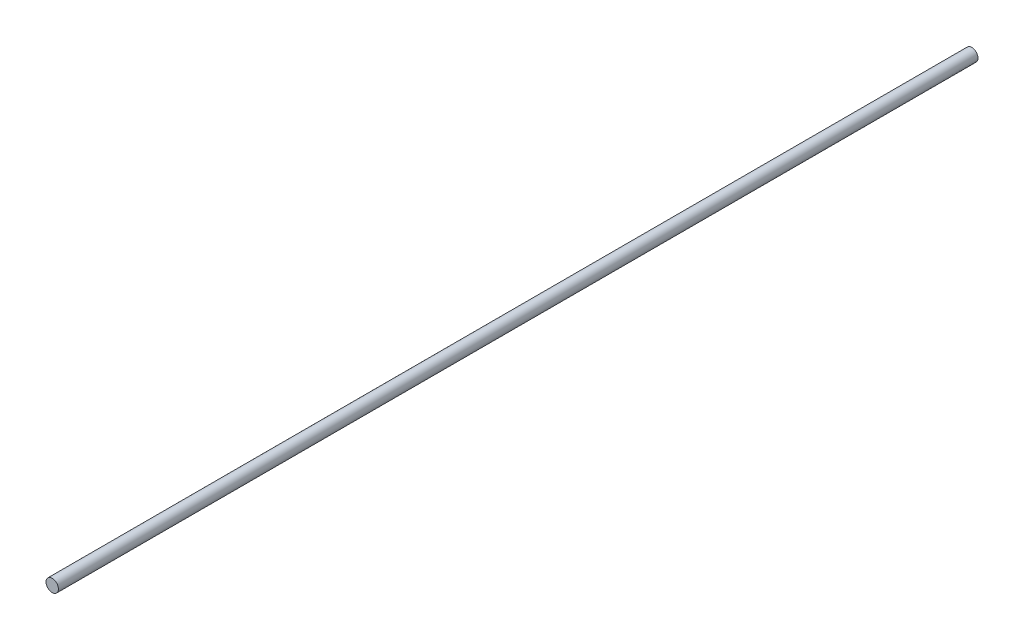
ISO-10303-21;
HEADER;
FILE_DESCRIPTION(('STEP AP214'),'2;1');
FILE_NAME('part.step','',(''),(''),'','','');
FILE_SCHEMA(('AUTOMOTIVE_DESIGN { 1 0 10303 214 1 1 1 1 }'));
ENDSEC;
DATA;
#1=APPLICATION_CONTEXT('core data for automotive mechanical design processes');
#2=APPLICATION_PROTOCOL_DEFINITION('international standard','automotive_design',2000,#1);
#3=PRODUCT_CONTEXT('',#1,'mechanical');
#4=PRODUCT('Part','Part','',(#3));
#5=PRODUCT_RELATED_PRODUCT_CATEGORY('part','',(#4));
#6=PRODUCT_DEFINITION_FORMATION('','',#4);
#7=PRODUCT_DEFINITION_CONTEXT('part definition',#1,'design');
#8=PRODUCT_DEFINITION('design','',#6,#7);
#9=PRODUCT_DEFINITION_SHAPE('','',#8);
#10=(LENGTH_UNIT() NAMED_UNIT(*) SI_UNIT(.MILLI.,.METRE.));
#11=(NAMED_UNIT(*) PLANE_ANGLE_UNIT() SI_UNIT($,.RADIAN.));
#12=(NAMED_UNIT(*) SI_UNIT($,.STERADIAN.) SOLID_ANGLE_UNIT());
#13=UNCERTAINTY_MEASURE_WITH_UNIT(LENGTH_MEASURE(1.E-05),#10,'distance_accuracy_value','');
#14=(GEOMETRIC_REPRESENTATION_CONTEXT(3) GLOBAL_UNCERTAINTY_ASSIGNED_CONTEXT((#13)) GLOBAL_UNIT_ASSIGNED_CONTEXT((#10,
#11,#12)) REPRESENTATION_CONTEXT('',''));
#15=CARTESIAN_POINT('',(0.,0.,0.));
#16=DIRECTION('',(0.,0.,1.));
#17=DIRECTION('',(1.,0.,0.));
#18=AXIS2_PLACEMENT_3D('',#15,#16,#17);
#19=CARTESIAN_POINT('',(0.,0.,370.));
#20=DIRECTION('',(0.,0.,-1.));
#21=DIRECTION('',(-1.,0.,0.));
#22=AXIS2_PLACEMENT_3D('',#19,#20,#21);
#23=CYLINDRICAL_SURFACE('',#22,2.5);
#24=CARTESIAN_POINT('',(0.,0.,370.));
#25=DIRECTION('',(0.,0.,1.));
#26=DIRECTION('',(1.,0.,0.));
#27=AXIS2_PLACEMENT_3D('',#24,#25,#26);
#28=CIRCLE('',#27,2.5);
#29=CARTESIAN_POINT('',(2.5,0.,370.));
#30=VERTEX_POINT('',#29);
#31=EDGE_CURVE('E10',#30,#30,#28,.T.);
#32=ORIENTED_EDGE('',*,*,#31,.F.);
#33=EDGE_LOOP('',(#32));
#34=FACE_BOUND('',#33,.T.);
#35=CARTESIAN_POINT('',(0.,0.,0.));
#36=DIRECTION('',(0.,0.,1.));
#37=DIRECTION('',(1.,0.,0.));
#38=AXIS2_PLACEMENT_3D('',#35,#36,#37);
#39=CIRCLE('',#38,2.5);
#40=CARTESIAN_POINT('',(2.5,0.,0.));
#41=VERTEX_POINT('',#40);
#42=EDGE_CURVE('E34',#41,#41,#39,.T.);
#43=ORIENTED_EDGE('',*,*,#42,.T.);
#44=EDGE_LOOP('',(#43));
#45=FACE_BOUND('',#44,.T.);
#46=ADVANCED_FACE('F31',(#34,#45),#23,.T.);
#47=CARTESIAN_POINT('',(0.,0.,370.));
#48=DIRECTION('',(0.,0.,1.));
#49=DIRECTION('',(1.,0.,0.));
#50=AXIS2_PLACEMENT_3D('',#47,#48,#49);
#51=PLANE('',#50);
#52=ORIENTED_EDGE('',*,*,#31,.T.);
#53=EDGE_LOOP('',(#52));
#54=FACE_BOUND('',#53,.T.);
#55=ADVANCED_FACE('F46',(#54),#51,.T.);
#56=CARTESIAN_POINT('',(0.,0.,0.));
#57=DIRECTION('',(0.,0.,1.));
#58=DIRECTION('',(1.,0.,0.));
#59=AXIS2_PLACEMENT_3D('',#56,#57,#58);
#60=PLANE('',#59);
#61=ORIENTED_EDGE('',*,*,#42,.F.);
#62=EDGE_LOOP('',(#61));
#63=FACE_BOUND('',#62,.T.);
#64=ADVANCED_FACE('F44',(#63),#60,.F.);
#65=CLOSED_SHELL('',(#46,#55,#64));
#66=MANIFOLD_SOLID_BREP('B2',#65);
#67=ADVANCED_BREP_SHAPE_REPRESENTATION('',(#18,#66),#14);
#68=SHAPE_DEFINITION_REPRESENTATION(#9,#67);
ENDSEC;
END-ISO-10303-21;
